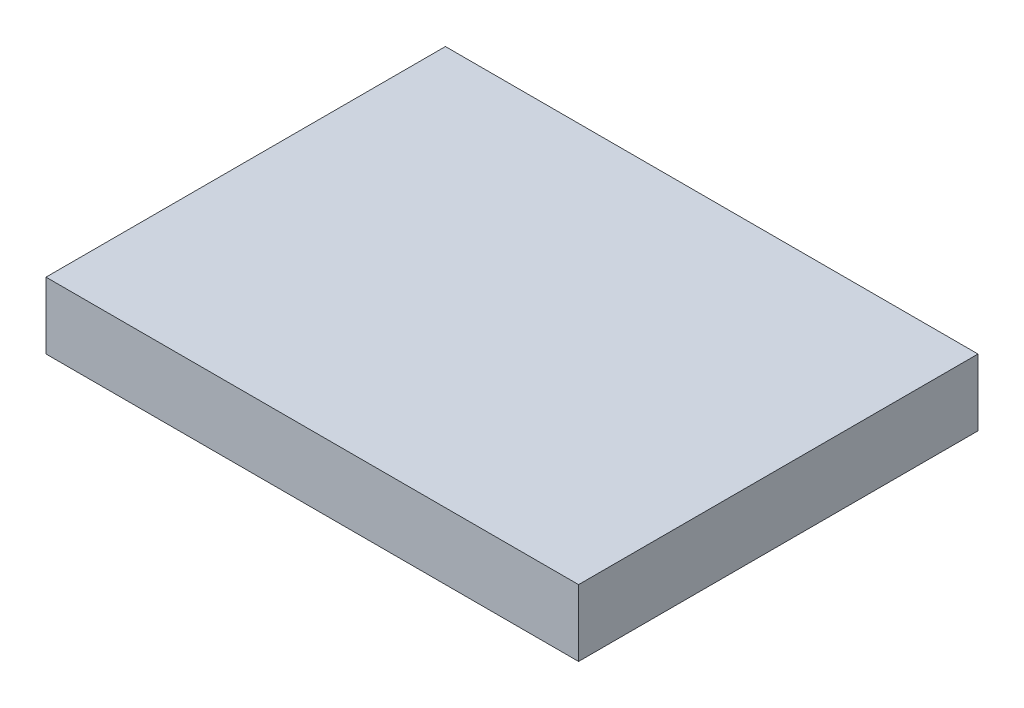
ISO-10303-21;
HEADER;
FILE_DESCRIPTION(('STEP AP214'),'2;1');
FILE_NAME('part.step','',(''),(''),'','','');
FILE_SCHEMA(('AUTOMOTIVE_DESIGN { 1 0 10303 214 1 1 1 1 }'));
ENDSEC;
DATA;
#1=APPLICATION_CONTEXT('core data for automotive mechanical design processes');
#2=APPLICATION_PROTOCOL_DEFINITION('international standard','automotive_design',2000,#1);
#3=PRODUCT_CONTEXT('',#1,'mechanical');
#4=PRODUCT('Part','Part','',(#3));
#5=PRODUCT_RELATED_PRODUCT_CATEGORY('part','',(#4));
#6=PRODUCT_DEFINITION_FORMATION('','',#4);
#7=PRODUCT_DEFINITION_CONTEXT('part definition',#1,'design');
#8=PRODUCT_DEFINITION('design','',#6,#7);
#9=PRODUCT_DEFINITION_SHAPE('','',#8);
#10=(LENGTH_UNIT() NAMED_UNIT(*) SI_UNIT(.MILLI.,.METRE.));
#11=(NAMED_UNIT(*) PLANE_ANGLE_UNIT() SI_UNIT($,.RADIAN.));
#12=(NAMED_UNIT(*) SI_UNIT($,.STERADIAN.) SOLID_ANGLE_UNIT());
#13=UNCERTAINTY_MEASURE_WITH_UNIT(LENGTH_MEASURE(1.E-05),#10,'distance_accuracy_value','');
#14=(GEOMETRIC_REPRESENTATION_CONTEXT(3) GLOBAL_UNCERTAINTY_ASSIGNED_CONTEXT((#13)) GLOBAL_UNIT_ASSIGNED_CONTEXT((#10,
#11,#12)) REPRESENTATION_CONTEXT('',''));
#15=CARTESIAN_POINT('',(0.,0.,0.));
#16=DIRECTION('',(0.,0.,1.));
#17=DIRECTION('',(1.,0.,0.));
#18=AXIS2_PLACEMENT_3D('',#15,#16,#17);
#19=CARTESIAN_POINT('',(24.,1.52,13.06));
#20=DIRECTION('',(0.,-1.,0.));
#21=DIRECTION('',(0.,0.,-1.));
#22=AXIS2_PLACEMENT_3D('',#19,#20,#21);
#23=PLANE('',#22);
#24=DIRECTION('',(0.,0.,1.));
#25=VECTOR('',#24,1.);
#26=CARTESIAN_POINT('',(23.2,1.52,13.36));
#27=LINE('',#26,#25);
#28=CARTESIAN_POINT('',(23.2,1.52,13.06));
#29=VERTEX_POINT('',#28);
#30=CARTESIAN_POINT('',(23.2,1.52,13.66));
#31=VERTEX_POINT('',#30);
#32=EDGE_CURVE('E68',#29,#31,#27,.T.);
#33=ORIENTED_EDGE('',*,*,#32,.F.);
#34=DIRECTION('',(-1.,0.,0.));
#35=VECTOR('',#34,1.);
#36=CARTESIAN_POINT('',(24.,1.52,13.06));
#37=LINE('',#36,#35);
#38=CARTESIAN_POINT('',(24.,1.52,13.06));
#39=VERTEX_POINT('',#38);
#40=EDGE_CURVE('E55',#39,#29,#37,.T.);
#41=ORIENTED_EDGE('',*,*,#40,.F.);
#42=DIRECTION('',(0.,0.,1.));
#43=VECTOR('',#42,1.);
#44=CARTESIAN_POINT('',(24.,1.52,13.36));
#45=LINE('',#44,#43);
#46=CARTESIAN_POINT('',(24.,1.52,13.66));
#47=VERTEX_POINT('',#46);
#48=EDGE_CURVE('E20',#39,#47,#45,.T.);
#49=ORIENTED_EDGE('',*,*,#48,.T.);
#50=DIRECTION('',(1.,0.,0.));
#51=VECTOR('',#50,1.);
#52=CARTESIAN_POINT('',(24.,1.52,13.66));
#53=LINE('',#52,#51);
#54=EDGE_CURVE('E81',#31,#47,#53,.T.);
#55=ORIENTED_EDGE('',*,*,#54,.F.);
#56=EDGE_LOOP('',(#33,#41,#49,#55));
#57=FACE_BOUND('',#56,.T.);
#58=ADVANCED_FACE('F17',(#57),#23,.T.);
#59=CARTESIAN_POINT('',(24.,1.57,13.36));
#60=DIRECTION('',(-1.,0.,0.));
#61=DIRECTION('',(0.,0.,1.));
#62=AXIS2_PLACEMENT_3D('',#59,#60,#61);
#63=PLANE('',#62);
#64=DIRECTION('',(0.,0.,1.));
#65=VECTOR('',#64,1.);
#66=CARTESIAN_POINT('',(24.,1.62,13.66));
#67=LINE('',#66,#65);
#68=CARTESIAN_POINT('',(24.,1.62,13.66));
#69=VERTEX_POINT('',#68);
#70=CARTESIAN_POINT('',(24.,1.62,13.06));
#71=VERTEX_POINT('',#70);
#72=EDGE_CURVE('E83',#69,#71,#67,.F.);
#73=ORIENTED_EDGE('',*,*,#72,.F.);
#74=DIRECTION('',(0.,1.,0.));
#75=VECTOR('',#74,1.);
#76=CARTESIAN_POINT('',(24.,1.52,13.66));
#77=LINE('',#76,#75);
#78=EDGE_CURVE('E64',#47,#69,#77,.T.);
#79=ORIENTED_EDGE('',*,*,#78,.F.);
#80=ORIENTED_EDGE('',*,*,#48,.F.);
#81=DIRECTION('',(0.,1.,0.));
#82=VECTOR('',#81,1.);
#83=CARTESIAN_POINT('',(24.,1.62,13.06));
#84=LINE('',#83,#82);
#85=EDGE_CURVE('E61',#71,#39,#84,.F.);
#86=ORIENTED_EDGE('',*,*,#85,.F.);
#87=EDGE_LOOP('',(#73,#79,#80,#86));
#88=FACE_BOUND('',#87,.T.);
#89=ADVANCED_FACE('F60',(#88),#63,.F.);
#90=CARTESIAN_POINT('',(24.,1.62,13.06));
#91=DIRECTION('',(0.,0.,-1.));
#92=DIRECTION('',(-1.,0.,0.));
#93=AXIS2_PLACEMENT_3D('',#90,#91,#92);
#94=PLANE('',#93);
#95=DIRECTION('',(0.,1.,0.));
#96=VECTOR('',#95,1.);
#97=CARTESIAN_POINT('',(23.2,1.57,13.06));
#98=LINE('',#97,#96);
#99=CARTESIAN_POINT('',(23.2,1.62,13.06));
#100=VERTEX_POINT('',#99);
#101=EDGE_CURVE('E70',#100,#29,#98,.F.);
#102=ORIENTED_EDGE('',*,*,#101,.F.);
#103=DIRECTION('',(1.,0.,0.));
#104=VECTOR('',#103,1.);
#105=CARTESIAN_POINT('',(24.,1.62,13.06));
#106=LINE('',#105,#104);
#107=EDGE_CURVE('E74',#71,#100,#106,.F.);
#108=ORIENTED_EDGE('',*,*,#107,.F.);
#109=ORIENTED_EDGE('',*,*,#85,.T.);
#110=ORIENTED_EDGE('',*,*,#40,.T.);
#111=EDGE_LOOP('',(#102,#108,#109,#110));
#112=FACE_BOUND('',#111,.T.);
#113=ADVANCED_FACE('F72',(#112),#94,.T.);
#114=CARTESIAN_POINT('',(23.2,1.57,13.36));
#115=DIRECTION('',(-1.,0.,0.));
#116=DIRECTION('',(0.,0.,1.));
#117=AXIS2_PLACEMENT_3D('',#114,#115,#116);
#118=PLANE('',#117);
#119=DIRECTION('',(0.,1.,0.));
#120=VECTOR('',#119,1.);
#121=CARTESIAN_POINT('',(23.2,1.52,13.66));
#122=LINE('',#121,#120);
#123=CARTESIAN_POINT('',(23.2,1.62,13.66));
#124=VERTEX_POINT('',#123);
#125=EDGE_CURVE('E35',#124,#31,#122,.F.);
#126=ORIENTED_EDGE('',*,*,#125,.F.);
#127=DIRECTION('',(0.,0.,1.));
#128=VECTOR('',#127,1.);
#129=CARTESIAN_POINT('',(23.2,1.62,13.66));
#130=LINE('',#129,#128);
#131=EDGE_CURVE('E26',#100,#124,#130,.T.);
#132=ORIENTED_EDGE('',*,*,#131,.F.);
#133=ORIENTED_EDGE('',*,*,#101,.T.);
#134=ORIENTED_EDGE('',*,*,#32,.T.);
#135=EDGE_LOOP('',(#126,#132,#133,#134));
#136=FACE_BOUND('',#135,.T.);
#137=ADVANCED_FACE('F89',(#136),#118,.T.);
#138=CARTESIAN_POINT('',(24.,1.52,13.66));
#139=DIRECTION('',(0.,0.,1.));
#140=DIRECTION('',(1.,0.,0.));
#141=AXIS2_PLACEMENT_3D('',#138,#139,#140);
#142=PLANE('',#141);
#143=ORIENTED_EDGE('',*,*,#125,.T.);
#144=ORIENTED_EDGE('',*,*,#54,.T.);
#145=ORIENTED_EDGE('',*,*,#78,.T.);
#146=DIRECTION('',(1.,0.,0.));
#147=VECTOR('',#146,1.);
#148=CARTESIAN_POINT('',(24.,1.62,13.66));
#149=LINE('',#148,#147);
#150=EDGE_CURVE('E11',#124,#69,#149,.T.);
#151=ORIENTED_EDGE('',*,*,#150,.F.);
#152=EDGE_LOOP('',(#143,#144,#145,#151));
#153=FACE_BOUND('',#152,.T.);
#154=ADVANCED_FACE('F91',(#153),#142,.T.);
#155=CARTESIAN_POINT('',(24.,1.62,13.66));
#156=DIRECTION('',(0.,1.,0.));
#157=DIRECTION('',(0.,0.,1.));
#158=AXIS2_PLACEMENT_3D('',#155,#156,#157);
#159=PLANE('',#158);
#160=ORIENTED_EDGE('',*,*,#131,.T.);
#161=ORIENTED_EDGE('',*,*,#150,.T.);
#162=ORIENTED_EDGE('',*,*,#72,.T.);
#163=ORIENTED_EDGE('',*,*,#107,.T.);
#164=EDGE_LOOP('',(#160,#161,#162,#163));
#165=FACE_BOUND('',#164,.T.);
#166=ADVANCED_FACE('F88',(#165),#159,.T.);
#167=CLOSED_SHELL('',(#58,#89,#113,#137,#154,#166));
#168=MANIFOLD_SOLID_BREP('B1',#167);
#169=ADVANCED_BREP_SHAPE_REPRESENTATION('',(#18,#168),#14);
#170=SHAPE_DEFINITION_REPRESENTATION(#9,#169);
ENDSEC;
END-ISO-10303-21;
